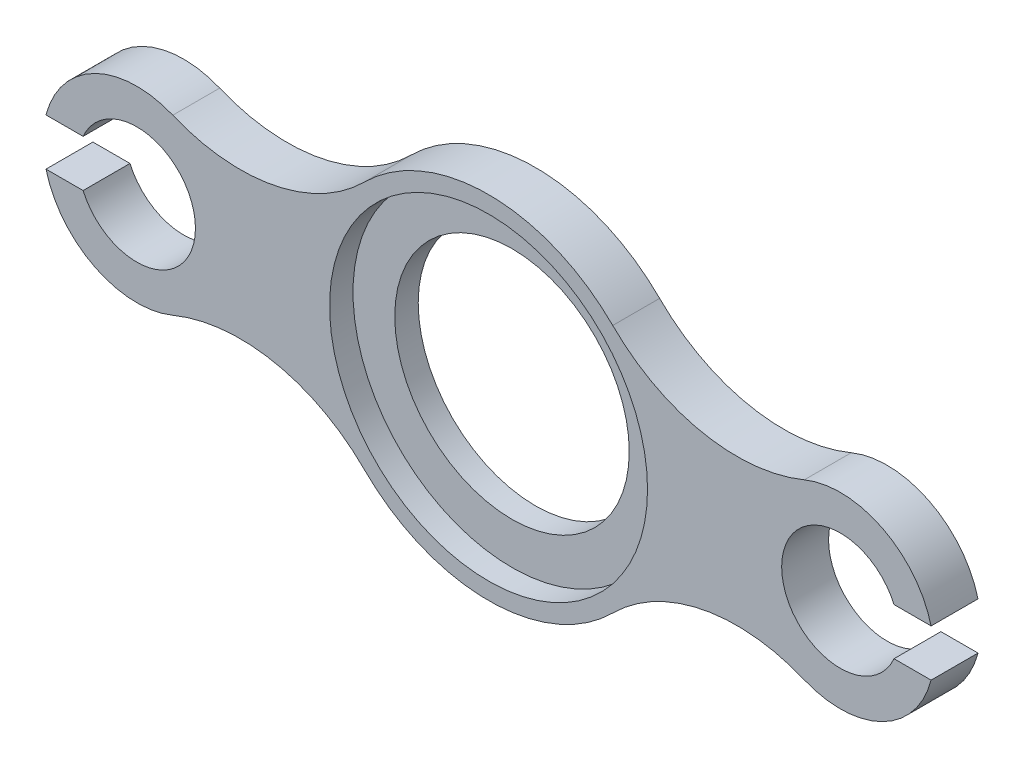
ISO-10303-21;
HEADER;
FILE_DESCRIPTION(('STEP AP214'),'2;1');
FILE_NAME('part.step','',(''),(''),'','','');
FILE_SCHEMA(('AUTOMOTIVE_DESIGN { 1 0 10303 214 1 1 1 1 }'));
ENDSEC;
DATA;
#1=APPLICATION_CONTEXT('core data for automotive mechanical design processes');
#2=APPLICATION_PROTOCOL_DEFINITION('international standard','automotive_design',2000,#1);
#3=PRODUCT_CONTEXT('',#1,'mechanical');
#4=PRODUCT('Part','Part','',(#3));
#5=PRODUCT_RELATED_PRODUCT_CATEGORY('part','',(#4));
#6=PRODUCT_DEFINITION_FORMATION('','',#4);
#7=PRODUCT_DEFINITION_CONTEXT('part definition',#1,'design');
#8=PRODUCT_DEFINITION('design','',#6,#7);
#9=PRODUCT_DEFINITION_SHAPE('','',#8);
#10=(LENGTH_UNIT() NAMED_UNIT(*) SI_UNIT(.MILLI.,.METRE.));
#11=(NAMED_UNIT(*) PLANE_ANGLE_UNIT() SI_UNIT($,.RADIAN.));
#12=(NAMED_UNIT(*) SI_UNIT($,.STERADIAN.) SOLID_ANGLE_UNIT());
#13=UNCERTAINTY_MEASURE_WITH_UNIT(LENGTH_MEASURE(1.E-05),#10,'distance_accuracy_value','');
#14=(GEOMETRIC_REPRESENTATION_CONTEXT(3) GLOBAL_UNCERTAINTY_ASSIGNED_CONTEXT((#13)) GLOBAL_UNIT_ASSIGNED_CONTEXT((#10,
#11,#12)) REPRESENTATION_CONTEXT('',''));
#15=CARTESIAN_POINT('',(0.,0.,0.));
#16=DIRECTION('',(0.,0.,1.));
#17=DIRECTION('',(1.,0.,0.));
#18=AXIS2_PLACEMENT_3D('',#15,#16,#17);
#19=CARTESIAN_POINT('',(0.,-10.,20.));
#20=DIRECTION('',(0.,1.,0.));
#21=DIRECTION('',(0.,0.,1.));
#22=AXIS2_PLACEMENT_3D('',#19,#20,#21);
#23=PLANE('',#22);
#24=DIRECTION('',(1.,0.,0.));
#25=VECTOR('',#24,1.);
#26=CARTESIAN_POINT('',(0.,-10.,0.));
#27=LINE('',#26,#25);
#28=CARTESIAN_POINT('',(-188.729833462074,-10.,0.));
#29=VERTEX_POINT('',#28);
#30=CARTESIAN_POINT('',(-172.912878474779,-10.,0.));
#31=VERTEX_POINT('',#30);
#32=EDGE_CURVE('E195',#29,#31,#27,.T.);
#33=ORIENTED_EDGE('',*,*,#32,.F.);
#34=DIRECTION('',(0.,0.,-1.));
#35=VECTOR('',#34,1.);
#36=CARTESIAN_POINT('',(-188.729833462074,-10.,20.));
#37=LINE('',#36,#35);
#38=CARTESIAN_POINT('',(-188.729833462074,-10.,20.));
#39=VERTEX_POINT('',#38);
#40=EDGE_CURVE('E58',#39,#29,#37,.T.);
#41=ORIENTED_EDGE('',*,*,#40,.F.);
#42=DIRECTION('',(1.,0.,0.));
#43=VECTOR('',#42,1.);
#44=CARTESIAN_POINT('',(0.,-10.,20.));
#45=LINE('',#44,#43);
#46=CARTESIAN_POINT('',(-172.912878474779,-10.,20.));
#47=VERTEX_POINT('',#46);
#48=EDGE_CURVE('E358',#39,#47,#45,.T.);
#49=ORIENTED_EDGE('',*,*,#48,.T.);
#50=DIRECTION('',(0.,0.,-1.));
#51=VECTOR('',#50,1.);
#52=CARTESIAN_POINT('',(-172.912878474779,-10.,20.));
#53=LINE('',#52,#51);
#54=EDGE_CURVE('E66',#47,#31,#53,.T.);
#55=ORIENTED_EDGE('',*,*,#54,.T.);
#56=EDGE_LOOP('',(#33,#41,#49,#55));
#57=FACE_BOUND('',#56,.T.);
#58=ADVANCED_FACE('F49',(#57),#23,.T.);
#59=CARTESIAN_POINT('',(-150.,0.,20.));
#60=DIRECTION('',(0.,0.,-1.));
#61=DIRECTION('',(-1.,0.,0.));
#62=AXIS2_PLACEMENT_3D('',#59,#60,#61);
#63=CYLINDRICAL_SURFACE('',#62,40.);
#64=CARTESIAN_POINT('',(-150.,0.,0.));
#65=DIRECTION('',(0.,0.,1.));
#66=DIRECTION('',(1.,0.,0.));
#67=AXIS2_PLACEMENT_3D('',#64,#65,#66);
#68=CIRCLE('',#67,40.);
#69=CARTESIAN_POINT('',(-134.666666666667,-36.9444026733264,0.));
#70=VERTEX_POINT('',#69);
#71=EDGE_CURVE('E197',#29,#70,#68,.T.);
#72=ORIENTED_EDGE('',*,*,#71,.T.);
#73=DIRECTION('',(0.,0.,-1.));
#74=VECTOR('',#73,1.);
#75=CARTESIAN_POINT('',(-134.666666666667,-36.9444026733264,20.));
#76=LINE('',#75,#74);
#77=CARTESIAN_POINT('',(-134.666666666667,-36.9444026733264,20.));
#78=VERTEX_POINT('',#77);
#79=EDGE_CURVE('E267',#78,#70,#76,.T.);
#80=ORIENTED_EDGE('',*,*,#79,.F.);
#81=CARTESIAN_POINT('',(-150.,0.,20.));
#82=DIRECTION('',(0.,0.,1.));
#83=DIRECTION('',(1.,0.,0.));
#84=AXIS2_PLACEMENT_3D('',#81,#82,#83);
#85=CIRCLE('',#84,40.);
#86=EDGE_CURVE('E274',#39,#78,#85,.T.);
#87=ORIENTED_EDGE('',*,*,#86,.F.);
#88=ORIENTED_EDGE('',*,*,#40,.T.);
#89=EDGE_LOOP('',(#72,#80,#87,#88));
#90=FACE_BOUND('',#89,.T.);
#91=ADVANCED_FACE('F271',(#90),#63,.T.);
#92=CARTESIAN_POINT('',(-105.916666666667,-106.215157685813,20.));
#93=DIRECTION('',(0.,0.,-1.));
#94=DIRECTION('',(-1.,0.,0.));
#95=AXIS2_PLACEMENT_3D('',#92,#93,#94);
#96=CYLINDRICAL_SURFACE('',#95,75.);
#97=CARTESIAN_POINT('',(-105.916666666667,-106.215157685813,0.));
#98=DIRECTION('',(0.,0.,1.));
#99=DIRECTION('',(1.,0.,0.));
#100=AXIS2_PLACEMENT_3D('',#97,#98,#99);
#101=CIRCLE('',#100,75.);
#102=CARTESIAN_POINT('',(-52.9583333333333,-53.1075788429067,0.));
#103=VERTEX_POINT('',#102);
#104=EDGE_CURVE('E201',#70,#103,#101,.F.);
#105=ORIENTED_EDGE('',*,*,#104,.T.);
#106=DIRECTION('',(0.,0.,-1.));
#107=VECTOR('',#106,1.);
#108=CARTESIAN_POINT('',(-52.9583333333333,-53.1075788429067,20.));
#109=LINE('',#108,#107);
#110=CARTESIAN_POINT('',(-52.9583333333333,-53.1075788429067,20.));
#111=VERTEX_POINT('',#110);
#112=EDGE_CURVE('E264',#111,#103,#109,.T.);
#113=ORIENTED_EDGE('',*,*,#112,.F.);
#114=CARTESIAN_POINT('',(-105.916666666667,-106.215157685813,20.));
#115=DIRECTION('',(0.,0.,1.));
#116=DIRECTION('',(1.,0.,0.));
#117=AXIS2_PLACEMENT_3D('',#114,#115,#116);
#118=CIRCLE('',#117,75.);
#119=EDGE_CURVE('E366',#78,#111,#118,.F.);
#120=ORIENTED_EDGE('',*,*,#119,.F.);
#121=ORIENTED_EDGE('',*,*,#79,.T.);
#122=EDGE_LOOP('',(#105,#113,#120,#121));
#123=FACE_BOUND('',#122,.T.);
#124=ADVANCED_FACE('F282',(#123),#96,.F.);
#125=CARTESIAN_POINT('',(0.,0.,20.));
#126=DIRECTION('',(0.,0.,-1.));
#127=DIRECTION('',(-1.,0.,0.));
#128=AXIS2_PLACEMENT_3D('',#125,#126,#127);
#129=CYLINDRICAL_SURFACE('',#128,75.);
#130=CARTESIAN_POINT('',(0.,0.,0.));
#131=DIRECTION('',(0.,0.,1.));
#132=DIRECTION('',(1.,0.,0.));
#133=AXIS2_PLACEMENT_3D('',#130,#131,#132);
#134=CIRCLE('',#133,75.);
#135=CARTESIAN_POINT('',(52.9583333333333,-53.1075788429067,0.));
#136=VERTEX_POINT('',#135);
#137=EDGE_CURVE('E204',#103,#136,#134,.T.);
#138=ORIENTED_EDGE('',*,*,#137,.T.);
#139=DIRECTION('',(0.,0.,-1.));
#140=VECTOR('',#139,1.);
#141=CARTESIAN_POINT('',(52.9583333333333,-53.1075788429067,20.));
#142=LINE('',#141,#140);
#143=CARTESIAN_POINT('',(52.9583333333333,-53.1075788429067,20.));
#144=VERTEX_POINT('',#143);
#145=EDGE_CURVE('E262',#144,#136,#142,.T.);
#146=ORIENTED_EDGE('',*,*,#145,.F.);
#147=CARTESIAN_POINT('',(0.,0.,20.));
#148=DIRECTION('',(0.,0.,1.));
#149=DIRECTION('',(1.,0.,0.));
#150=AXIS2_PLACEMENT_3D('',#147,#148,#149);
#151=CIRCLE('',#150,75.);
#152=EDGE_CURVE('E369',#111,#144,#151,.T.);
#153=ORIENTED_EDGE('',*,*,#152,.F.);
#154=ORIENTED_EDGE('',*,*,#112,.T.);
#155=EDGE_LOOP('',(#138,#146,#153,#154));
#156=FACE_BOUND('',#155,.T.);
#157=ADVANCED_FACE('F287',(#156),#129,.T.);
#158=CARTESIAN_POINT('',(105.916666666667,-106.215157685813,20.));
#159=DIRECTION('',(0.,0.,-1.));
#160=DIRECTION('',(-1.,0.,0.));
#161=AXIS2_PLACEMENT_3D('',#158,#159,#160);
#162=CYLINDRICAL_SURFACE('',#161,75.);
#163=CARTESIAN_POINT('',(105.916666666667,-106.215157685813,0.));
#164=DIRECTION('',(0.,0.,1.));
#165=DIRECTION('',(1.,0.,0.));
#166=AXIS2_PLACEMENT_3D('',#163,#164,#165);
#167=CIRCLE('',#166,75.);
#168=CARTESIAN_POINT('',(134.666666666667,-36.9444026733264,0.));
#169=VERTEX_POINT('',#168);
#170=EDGE_CURVE('E207',#169,#136,#167,.T.);
#171=ORIENTED_EDGE('',*,*,#170,.F.);
#172=DIRECTION('',(0.,0.,-1.));
#173=VECTOR('',#172,1.);
#174=CARTESIAN_POINT('',(134.666666666667,-36.9444026733264,20.));
#175=LINE('',#174,#173);
#176=CARTESIAN_POINT('',(134.666666666667,-36.9444026733264,20.));
#177=VERTEX_POINT('',#176);
#178=EDGE_CURVE('E260',#177,#169,#175,.T.);
#179=ORIENTED_EDGE('',*,*,#178,.F.);
#180=CARTESIAN_POINT('',(105.916666666667,-106.215157685813,20.));
#181=DIRECTION('',(0.,0.,1.));
#182=DIRECTION('',(1.,0.,0.));
#183=AXIS2_PLACEMENT_3D('',#180,#181,#182);
#184=CIRCLE('',#183,75.);
#185=EDGE_CURVE('E371',#177,#144,#184,.T.);
#186=ORIENTED_EDGE('',*,*,#185,.T.);
#187=ORIENTED_EDGE('',*,*,#145,.T.);
#188=EDGE_LOOP('',(#171,#179,#186,#187));
#189=FACE_BOUND('',#188,.T.);
#190=ADVANCED_FACE('F291',(#189),#162,.F.);
#191=CARTESIAN_POINT('',(150.,0.,20.));
#192=DIRECTION('',(0.,0.,-1.));
#193=DIRECTION('',(-1.,0.,0.));
#194=AXIS2_PLACEMENT_3D('',#191,#192,#193);
#195=CYLINDRICAL_SURFACE('',#194,40.);
#196=CARTESIAN_POINT('',(150.,0.,0.));
#197=DIRECTION('',(0.,0.,1.));
#198=DIRECTION('',(1.,0.,0.));
#199=AXIS2_PLACEMENT_3D('',#196,#197,#198);
#200=CIRCLE('',#199,40.);
#201=CARTESIAN_POINT('',(188.729833462074,-10.,0.));
#202=VERTEX_POINT('',#201);
#203=EDGE_CURVE('E210',#202,#169,#200,.F.);
#204=ORIENTED_EDGE('',*,*,#203,.F.);
#205=DIRECTION('',(0.,0.,-1.));
#206=VECTOR('',#205,1.);
#207=CARTESIAN_POINT('',(188.729833462074,-10.,20.));
#208=LINE('',#207,#206);
#209=CARTESIAN_POINT('',(188.729833462074,-10.,20.));
#210=VERTEX_POINT('',#209);
#211=EDGE_CURVE('E258',#210,#202,#208,.T.);
#212=ORIENTED_EDGE('',*,*,#211,.F.);
#213=CARTESIAN_POINT('',(150.,0.,20.));
#214=DIRECTION('',(0.,0.,1.));
#215=DIRECTION('',(1.,0.,0.));
#216=AXIS2_PLACEMENT_3D('',#213,#214,#215);
#217=CIRCLE('',#216,40.);
#218=EDGE_CURVE('E374',#210,#177,#217,.F.);
#219=ORIENTED_EDGE('',*,*,#218,.T.);
#220=ORIENTED_EDGE('',*,*,#178,.T.);
#221=EDGE_LOOP('',(#204,#212,#219,#220));
#222=FACE_BOUND('',#221,.T.);
#223=ADVANCED_FACE('F295',(#222),#195,.T.);
#224=CARTESIAN_POINT('',(0.,-10.,20.));
#225=DIRECTION('',(0.,-1.,0.));
#226=DIRECTION('',(0.,0.,-1.));
#227=AXIS2_PLACEMENT_3D('',#224,#225,#226);
#228=PLANE('',#227);
#229=DIRECTION('',(-1.,0.,0.));
#230=VECTOR('',#229,1.);
#231=CARTESIAN_POINT('',(0.,-10.,0.));
#232=LINE('',#231,#230);
#233=CARTESIAN_POINT('',(172.912878474779,-10.,0.));
#234=VERTEX_POINT('',#233);
#235=EDGE_CURVE('E213',#202,#234,#232,.T.);
#236=ORIENTED_EDGE('',*,*,#235,.T.);
#237=DIRECTION('',(0.,0.,-1.));
#238=VECTOR('',#237,1.);
#239=CARTESIAN_POINT('',(172.912878474779,-10.,20.));
#240=LINE('',#239,#238);
#241=CARTESIAN_POINT('',(172.912878474779,-10.,20.));
#242=VERTEX_POINT('',#241);
#243=EDGE_CURVE('E255',#242,#234,#240,.T.);
#244=ORIENTED_EDGE('',*,*,#243,.F.);
#245=DIRECTION('',(-1.,0.,0.));
#246=VECTOR('',#245,1.);
#247=CARTESIAN_POINT('',(0.,-10.,20.));
#248=LINE('',#247,#246);
#249=EDGE_CURVE('E377',#210,#242,#248,.T.);
#250=ORIENTED_EDGE('',*,*,#249,.F.);
#251=ORIENTED_EDGE('',*,*,#211,.T.);
#252=EDGE_LOOP('',(#236,#244,#250,#251));
#253=FACE_BOUND('',#252,.T.);
#254=ADVANCED_FACE('F299',(#253),#228,.F.);
#255=CARTESIAN_POINT('',(150.,0.,20.));
#256=DIRECTION('',(0.,0.,-1.));
#257=DIRECTION('',(-1.,0.,0.));
#258=AXIS2_PLACEMENT_3D('',#255,#256,#257);
#259=CYLINDRICAL_SURFACE('',#258,25.);
#260=CARTESIAN_POINT('',(150.,0.,0.));
#261=DIRECTION('',(0.,0.,1.));
#262=DIRECTION('',(1.,0.,0.));
#263=AXIS2_PLACEMENT_3D('',#260,#261,#262);
#264=CIRCLE('',#263,25.);
#265=CARTESIAN_POINT('',(172.912878474779,10.,0.));
#266=VERTEX_POINT('',#265);
#267=EDGE_CURVE('E216',#234,#266,#264,.F.);
#268=ORIENTED_EDGE('',*,*,#267,.T.);
#269=DIRECTION('',(0.,0.,-1.));
#270=VECTOR('',#269,1.);
#271=CARTESIAN_POINT('',(172.912878474779,10.,20.));
#272=LINE('',#271,#270);
#273=CARTESIAN_POINT('',(172.912878474779,10.,20.));
#274=VERTEX_POINT('',#273);
#275=EDGE_CURVE('E253',#274,#266,#272,.T.);
#276=ORIENTED_EDGE('',*,*,#275,.F.);
#277=CARTESIAN_POINT('',(150.,0.,20.));
#278=DIRECTION('',(0.,0.,1.));
#279=DIRECTION('',(1.,0.,0.));
#280=AXIS2_PLACEMENT_3D('',#277,#278,#279);
#281=CIRCLE('',#280,25.);
#282=EDGE_CURVE('E380',#242,#274,#281,.F.);
#283=ORIENTED_EDGE('',*,*,#282,.F.);
#284=ORIENTED_EDGE('',*,*,#243,.T.);
#285=EDGE_LOOP('',(#268,#276,#283,#284));
#286=FACE_BOUND('',#285,.T.);
#287=ADVANCED_FACE('F303',(#286),#259,.F.);
#288=CARTESIAN_POINT('',(0.,10.,20.));
#289=DIRECTION('',(0.,-1.,0.));
#290=DIRECTION('',(0.,0.,-1.));
#291=AXIS2_PLACEMENT_3D('',#288,#289,#290);
#292=PLANE('',#291);
#293=DIRECTION('',(-1.,0.,0.));
#294=VECTOR('',#293,1.);
#295=CARTESIAN_POINT('',(0.,10.,0.));
#296=LINE('',#295,#294);
#297=CARTESIAN_POINT('',(188.729833462074,10.,0.));
#298=VERTEX_POINT('',#297);
#299=EDGE_CURVE('E219',#298,#266,#296,.T.);
#300=ORIENTED_EDGE('',*,*,#299,.F.);
#301=DIRECTION('',(0.,0.,-1.));
#302=VECTOR('',#301,1.);
#303=CARTESIAN_POINT('',(188.729833462074,10.,20.));
#304=LINE('',#303,#302);
#305=CARTESIAN_POINT('',(188.729833462074,10.,20.));
#306=VERTEX_POINT('',#305);
#307=EDGE_CURVE('E251',#306,#298,#304,.T.);
#308=ORIENTED_EDGE('',*,*,#307,.F.);
#309=DIRECTION('',(-1.,0.,0.));
#310=VECTOR('',#309,1.);
#311=CARTESIAN_POINT('',(0.,10.,20.));
#312=LINE('',#311,#310);
#313=EDGE_CURVE('E382',#306,#274,#312,.T.);
#314=ORIENTED_EDGE('',*,*,#313,.T.);
#315=ORIENTED_EDGE('',*,*,#275,.T.);
#316=EDGE_LOOP('',(#300,#308,#314,#315));
#317=FACE_BOUND('',#316,.T.);
#318=ADVANCED_FACE('F307',(#317),#292,.T.);
#319=CARTESIAN_POINT('',(150.,0.,20.));
#320=DIRECTION('',(0.,0.,-1.));
#321=DIRECTION('',(-1.,0.,0.));
#322=AXIS2_PLACEMENT_3D('',#319,#320,#321);
#323=CYLINDRICAL_SURFACE('',#322,40.);
#324=CARTESIAN_POINT('',(150.,0.,0.));
#325=DIRECTION('',(0.,0.,1.));
#326=DIRECTION('',(1.,0.,0.));
#327=AXIS2_PLACEMENT_3D('',#324,#325,#326);
#328=CIRCLE('',#327,40.);
#329=CARTESIAN_POINT('',(134.666666666667,36.9444026733264,0.));
#330=VERTEX_POINT('',#329);
#331=EDGE_CURVE('E222',#298,#330,#328,.T.);
#332=ORIENTED_EDGE('',*,*,#331,.T.);
#333=DIRECTION('',(0.,0.,-1.));
#334=VECTOR('',#333,1.);
#335=CARTESIAN_POINT('',(134.666666666667,36.9444026733264,20.));
#336=LINE('',#335,#334);
#337=CARTESIAN_POINT('',(134.666666666667,36.9444026733264,20.));
#338=VERTEX_POINT('',#337);
#339=EDGE_CURVE('E248',#338,#330,#336,.T.);
#340=ORIENTED_EDGE('',*,*,#339,.F.);
#341=CARTESIAN_POINT('',(150.,0.,20.));
#342=DIRECTION('',(0.,0.,1.));
#343=DIRECTION('',(1.,0.,0.));
#344=AXIS2_PLACEMENT_3D('',#341,#342,#343);
#345=CIRCLE('',#344,40.);
#346=EDGE_CURVE('E385',#306,#338,#345,.T.);
#347=ORIENTED_EDGE('',*,*,#346,.F.);
#348=ORIENTED_EDGE('',*,*,#307,.T.);
#349=EDGE_LOOP('',(#332,#340,#347,#348));
#350=FACE_BOUND('',#349,.T.);
#351=ADVANCED_FACE('F311',(#350),#323,.T.);
#352=CARTESIAN_POINT('',(105.916666666667,106.215157685813,20.));
#353=DIRECTION('',(0.,0.,-1.));
#354=DIRECTION('',(-1.,0.,0.));
#355=AXIS2_PLACEMENT_3D('',#352,#353,#354);
#356=CYLINDRICAL_SURFACE('',#355,75.);
#357=CARTESIAN_POINT('',(105.916666666667,106.215157685813,0.));
#358=DIRECTION('',(0.,0.,1.));
#359=DIRECTION('',(1.,0.,0.));
#360=AXIS2_PLACEMENT_3D('',#357,#358,#359);
#361=CIRCLE('',#360,75.);
#362=CARTESIAN_POINT('',(52.9583333333334,53.1075788429067,0.));
#363=VERTEX_POINT('',#362);
#364=EDGE_CURVE('E225',#330,#363,#361,.F.);
#365=ORIENTED_EDGE('',*,*,#364,.T.);
#366=DIRECTION('',(0.,0.,-1.));
#367=VECTOR('',#366,1.);
#368=CARTESIAN_POINT('',(52.9583333333334,53.1075788429067,20.));
#369=LINE('',#368,#367);
#370=CARTESIAN_POINT('',(52.9583333333334,53.1075788429067,20.));
#371=VERTEX_POINT('',#370);
#372=EDGE_CURVE('E246',#371,#363,#369,.T.);
#373=ORIENTED_EDGE('',*,*,#372,.F.);
#374=CARTESIAN_POINT('',(105.916666666667,106.215157685813,20.));
#375=DIRECTION('',(0.,0.,1.));
#376=DIRECTION('',(1.,0.,0.));
#377=AXIS2_PLACEMENT_3D('',#374,#375,#376);
#378=CIRCLE('',#377,75.);
#379=EDGE_CURVE('E388',#338,#371,#378,.F.);
#380=ORIENTED_EDGE('',*,*,#379,.F.);
#381=ORIENTED_EDGE('',*,*,#339,.T.);
#382=EDGE_LOOP('',(#365,#373,#380,#381));
#383=FACE_BOUND('',#382,.T.);
#384=ADVANCED_FACE('F315',(#383),#356,.F.);
#385=CARTESIAN_POINT('',(0.,0.,20.));
#386=DIRECTION('',(0.,0.,-1.));
#387=DIRECTION('',(-1.,0.,0.));
#388=AXIS2_PLACEMENT_3D('',#385,#386,#387);
#389=CYLINDRICAL_SURFACE('',#388,75.);
#390=CARTESIAN_POINT('',(0.,0.,0.));
#391=DIRECTION('',(0.,0.,1.));
#392=DIRECTION('',(1.,0.,0.));
#393=AXIS2_PLACEMENT_3D('',#390,#391,#392);
#394=CIRCLE('',#393,75.);
#395=CARTESIAN_POINT('',(-52.9583333333334,53.1075788429067,0.));
#396=VERTEX_POINT('',#395);
#397=EDGE_CURVE('E228',#396,#363,#394,.F.);
#398=ORIENTED_EDGE('',*,*,#397,.F.);
#399=DIRECTION('',(0.,0.,-1.));
#400=VECTOR('',#399,1.);
#401=CARTESIAN_POINT('',(-52.9583333333334,53.1075788429067,20.));
#402=LINE('',#401,#400);
#403=CARTESIAN_POINT('',(-52.9583333333334,53.1075788429067,20.));
#404=VERTEX_POINT('',#403);
#405=EDGE_CURVE('E244',#404,#396,#402,.T.);
#406=ORIENTED_EDGE('',*,*,#405,.F.);
#407=CARTESIAN_POINT('',(0.,0.,20.));
#408=DIRECTION('',(0.,0.,1.));
#409=DIRECTION('',(1.,0.,0.));
#410=AXIS2_PLACEMENT_3D('',#407,#408,#409);
#411=CIRCLE('',#410,75.);
#412=EDGE_CURVE('E190',#404,#371,#411,.F.);
#413=ORIENTED_EDGE('',*,*,#412,.T.);
#414=ORIENTED_EDGE('',*,*,#372,.T.);
#415=EDGE_LOOP('',(#398,#406,#413,#414));
#416=FACE_BOUND('',#415,.T.);
#417=ADVANCED_FACE('F319',(#416),#389,.T.);
#418=CARTESIAN_POINT('',(-105.916666666667,106.215157685813,20.));
#419=DIRECTION('',(0.,0.,-1.));
#420=DIRECTION('',(-1.,0.,0.));
#421=AXIS2_PLACEMENT_3D('',#418,#419,#420);
#422=CYLINDRICAL_SURFACE('',#421,75.);
#423=CARTESIAN_POINT('',(-105.916666666667,106.215157685813,0.));
#424=DIRECTION('',(0.,0.,1.));
#425=DIRECTION('',(1.,0.,0.));
#426=AXIS2_PLACEMENT_3D('',#423,#424,#425);
#427=CIRCLE('',#426,75.);
#428=CARTESIAN_POINT('',(-134.666666666667,36.9444026733264,0.));
#429=VERTEX_POINT('',#428);
#430=EDGE_CURVE('E231',#429,#396,#427,.T.);
#431=ORIENTED_EDGE('',*,*,#430,.F.);
#432=DIRECTION('',(0.,0.,-1.));
#433=VECTOR('',#432,1.);
#434=CARTESIAN_POINT('',(-134.666666666667,36.9444026733264,20.));
#435=LINE('',#434,#433);
#436=CARTESIAN_POINT('',(-134.666666666667,36.9444026733264,20.));
#437=VERTEX_POINT('',#436);
#438=EDGE_CURVE('E175',#437,#429,#435,.T.);
#439=ORIENTED_EDGE('',*,*,#438,.F.);
#440=CARTESIAN_POINT('',(-105.916666666667,106.215157685813,20.));
#441=DIRECTION('',(0.,0.,1.));
#442=DIRECTION('',(1.,0.,0.));
#443=AXIS2_PLACEMENT_3D('',#440,#441,#442);
#444=CIRCLE('',#443,75.);
#445=EDGE_CURVE('E188',#437,#404,#444,.T.);
#446=ORIENTED_EDGE('',*,*,#445,.T.);
#447=ORIENTED_EDGE('',*,*,#405,.T.);
#448=EDGE_LOOP('',(#431,#439,#446,#447));
#449=FACE_BOUND('',#448,.T.);
#450=ADVANCED_FACE('F323',(#449),#422,.F.);
#451=CARTESIAN_POINT('',(-150.,0.,20.));
#452=DIRECTION('',(0.,0.,-1.));
#453=DIRECTION('',(-1.,0.,0.));
#454=AXIS2_PLACEMENT_3D('',#451,#452,#453);
#455=CYLINDRICAL_SURFACE('',#454,40.);
#456=CARTESIAN_POINT('',(-150.,0.,0.));
#457=DIRECTION('',(0.,0.,1.));
#458=DIRECTION('',(1.,0.,0.));
#459=AXIS2_PLACEMENT_3D('',#456,#457,#458);
#460=CIRCLE('',#459,40.);
#461=CARTESIAN_POINT('',(-188.729833462074,10.,0.));
#462=VERTEX_POINT('',#461);
#463=EDGE_CURVE('E172',#462,#429,#460,.F.);
#464=ORIENTED_EDGE('',*,*,#463,.F.);
#465=DIRECTION('',(0.,0.,-1.));
#466=VECTOR('',#465,1.);
#467=CARTESIAN_POINT('',(-188.729833462074,10.,20.));
#468=LINE('',#467,#466);
#469=CARTESIAN_POINT('',(-188.729833462074,10.,20.));
#470=VERTEX_POINT('',#469);
#471=EDGE_CURVE('E166',#470,#462,#468,.T.);
#472=ORIENTED_EDGE('',*,*,#471,.F.);
#473=CARTESIAN_POINT('',(-150.,0.,20.));
#474=DIRECTION('',(0.,0.,1.));
#475=DIRECTION('',(1.,0.,0.));
#476=AXIS2_PLACEMENT_3D('',#473,#474,#475);
#477=CIRCLE('',#476,40.);
#478=EDGE_CURVE('E170',#470,#437,#477,.F.);
#479=ORIENTED_EDGE('',*,*,#478,.T.);
#480=ORIENTED_EDGE('',*,*,#438,.T.);
#481=EDGE_LOOP('',(#464,#472,#479,#480));
#482=FACE_BOUND('',#481,.T.);
#483=ADVANCED_FACE('F168',(#482),#455,.T.);
#484=CARTESIAN_POINT('',(0.,10.,20.));
#485=DIRECTION('',(0.,1.,0.));
#486=DIRECTION('',(0.,0.,1.));
#487=AXIS2_PLACEMENT_3D('',#484,#485,#486);
#488=PLANE('',#487);
#489=DIRECTION('',(1.,0.,0.));
#490=VECTOR('',#489,1.);
#491=CARTESIAN_POINT('',(0.,10.,0.));
#492=LINE('',#491,#490);
#493=CARTESIAN_POINT('',(-172.912878474779,10.,0.));
#494=VERTEX_POINT('',#493);
#495=EDGE_CURVE('E235',#462,#494,#492,.T.);
#496=ORIENTED_EDGE('',*,*,#495,.T.);
#497=DIRECTION('',(0.,0.,-1.));
#498=VECTOR('',#497,1.);
#499=CARTESIAN_POINT('',(-172.912878474779,10.,20.));
#500=LINE('',#499,#498);
#501=CARTESIAN_POINT('',(-172.912878474779,10.,20.));
#502=VERTEX_POINT('',#501);
#503=EDGE_CURVE('E117',#502,#494,#500,.T.);
#504=ORIENTED_EDGE('',*,*,#503,.F.);
#505=DIRECTION('',(1.,0.,0.));
#506=VECTOR('',#505,1.);
#507=CARTESIAN_POINT('',(0.,10.,20.));
#508=LINE('',#507,#506);
#509=EDGE_CURVE('E177',#470,#502,#508,.T.);
#510=ORIENTED_EDGE('',*,*,#509,.F.);
#511=ORIENTED_EDGE('',*,*,#471,.T.);
#512=EDGE_LOOP('',(#496,#504,#510,#511));
#513=FACE_BOUND('',#512,.T.);
#514=ADVANCED_FACE('F178',(#513),#488,.F.);
#515=CARTESIAN_POINT('',(0.,0.,20.));
#516=DIRECTION('',(0.,0.,-1.));
#517=DIRECTION('',(-1.,0.,0.));
#518=AXIS2_PLACEMENT_3D('',#515,#516,#517);
#519=CYLINDRICAL_SURFACE('',#518,67.8);
#520=CARTESIAN_POINT('',(0.,0.,10.));
#521=DIRECTION('',(0.,0.,1.));
#522=DIRECTION('',(1.,0.,0.));
#523=AXIS2_PLACEMENT_3D('',#520,#521,#522);
#524=CIRCLE('',#523,67.8);
#525=CARTESIAN_POINT('',(67.8,0.,10.));
#526=VERTEX_POINT('',#525);
#527=EDGE_CURVE('E11',#526,#526,#524,.T.);
#528=ORIENTED_EDGE('',*,*,#527,.F.);
#529=EDGE_LOOP('',(#528));
#530=FACE_BOUND('',#529,.T.);
#531=CARTESIAN_POINT('',(0.,0.,20.));
#532=DIRECTION('',(0.,0.,1.));
#533=DIRECTION('',(1.,0.,0.));
#534=AXIS2_PLACEMENT_3D('',#531,#532,#533);
#535=CIRCLE('',#534,67.8);
#536=CARTESIAN_POINT('',(67.8,0.,20.));
#537=VERTEX_POINT('',#536);
#538=EDGE_CURVE('E240',#537,#537,#535,.T.);
#539=ORIENTED_EDGE('',*,*,#538,.T.);
#540=EDGE_LOOP('',(#539));
#541=FACE_BOUND('',#540,.T.);
#542=ADVANCED_FACE('F51',(#530,#541),#519,.F.);
#543=CARTESIAN_POINT('',(-150.,0.,20.));
#544=DIRECTION('',(0.,0.,-1.));
#545=DIRECTION('',(-1.,0.,0.));
#546=AXIS2_PLACEMENT_3D('',#543,#544,#545);
#547=CYLINDRICAL_SURFACE('',#546,25.);
#548=CARTESIAN_POINT('',(-150.,0.,0.));
#549=DIRECTION('',(0.,0.,1.));
#550=DIRECTION('',(1.,0.,0.));
#551=AXIS2_PLACEMENT_3D('',#548,#549,#550);
#552=CIRCLE('',#551,25.);
#553=EDGE_CURVE('E237',#31,#494,#552,.T.);
#554=ORIENTED_EDGE('',*,*,#553,.F.);
#555=ORIENTED_EDGE('',*,*,#54,.F.);
#556=CARTESIAN_POINT('',(-150.,0.,20.));
#557=DIRECTION('',(0.,0.,1.));
#558=DIRECTION('',(1.,0.,0.));
#559=AXIS2_PLACEMENT_3D('',#556,#557,#558);
#560=CIRCLE('',#559,25.);
#561=EDGE_CURVE('E181',#47,#502,#560,.T.);
#562=ORIENTED_EDGE('',*,*,#561,.T.);
#563=ORIENTED_EDGE('',*,*,#503,.T.);
#564=EDGE_LOOP('',(#554,#555,#562,#563));
#565=FACE_BOUND('',#564,.T.);
#566=ADVANCED_FACE('F332',(#565),#547,.F.);
#567=CARTESIAN_POINT('',(0.,0.,20.));
#568=DIRECTION('',(0.,0.,1.));
#569=DIRECTION('',(1.,0.,0.));
#570=AXIS2_PLACEMENT_3D('',#567,#568,#569);
#571=PLANE('',#570);
#572=ORIENTED_EDGE('',*,*,#538,.F.);
#573=EDGE_LOOP('',(#572));
#574=FACE_BOUND('',#573,.T.);
#575=ORIENTED_EDGE('',*,*,#48,.F.);
#576=ORIENTED_EDGE('',*,*,#86,.T.);
#577=ORIENTED_EDGE('',*,*,#119,.T.);
#578=ORIENTED_EDGE('',*,*,#152,.T.);
#579=ORIENTED_EDGE('',*,*,#185,.F.);
#580=ORIENTED_EDGE('',*,*,#218,.F.);
#581=ORIENTED_EDGE('',*,*,#249,.T.);
#582=ORIENTED_EDGE('',*,*,#282,.T.);
#583=ORIENTED_EDGE('',*,*,#313,.F.);
#584=ORIENTED_EDGE('',*,*,#346,.T.);
#585=ORIENTED_EDGE('',*,*,#379,.T.);
#586=ORIENTED_EDGE('',*,*,#412,.F.);
#587=ORIENTED_EDGE('',*,*,#445,.F.);
#588=ORIENTED_EDGE('',*,*,#478,.F.);
#589=ORIENTED_EDGE('',*,*,#509,.T.);
#590=ORIENTED_EDGE('',*,*,#561,.F.);
#591=EDGE_LOOP('',(#575,#576,#577,#578,#579,#580,#581,#582,#583,#584,#585,#586,#587,#588,#589,#590));
#592=FACE_BOUND('',#591,.T.);
#593=ADVANCED_FACE('F185',(#574,#592),#571,.T.);
#594=CARTESIAN_POINT('',(0.,0.,0.));
#595=DIRECTION('',(0.,0.,1.));
#596=DIRECTION('',(1.,0.,0.));
#597=AXIS2_PLACEMENT_3D('',#594,#595,#596);
#598=PLANE('',#597);
#599=ORIENTED_EDGE('',*,*,#32,.T.);
#600=ORIENTED_EDGE('',*,*,#553,.T.);
#601=ORIENTED_EDGE('',*,*,#495,.F.);
#602=ORIENTED_EDGE('',*,*,#463,.T.);
#603=ORIENTED_EDGE('',*,*,#430,.T.);
#604=ORIENTED_EDGE('',*,*,#397,.T.);
#605=ORIENTED_EDGE('',*,*,#364,.F.);
#606=ORIENTED_EDGE('',*,*,#331,.F.);
#607=ORIENTED_EDGE('',*,*,#299,.T.);
#608=ORIENTED_EDGE('',*,*,#267,.F.);
#609=ORIENTED_EDGE('',*,*,#235,.F.);
#610=ORIENTED_EDGE('',*,*,#203,.T.);
#611=ORIENTED_EDGE('',*,*,#170,.T.);
#612=ORIENTED_EDGE('',*,*,#137,.F.);
#613=ORIENTED_EDGE('',*,*,#104,.F.);
#614=ORIENTED_EDGE('',*,*,#71,.F.);
#615=EDGE_LOOP('',(#599,#600,#601,#602,#603,#604,#605,#606,#607,#608,#609,#610,#611,#612,#613,#614));
#616=FACE_BOUND('',#615,.T.);
#617=CARTESIAN_POINT('',(0.,0.,0.));
#618=DIRECTION('',(0.,0.,1.));
#619=DIRECTION('',(1.,0.,0.));
#620=AXIS2_PLACEMENT_3D('',#617,#618,#619);
#621=CIRCLE('',#620,50.);
#622=CARTESIAN_POINT('',(50.,0.,0.));
#623=VERTEX_POINT('',#622);
#624=EDGE_CURVE('E362',#623,#623,#621,.T.);
#625=ORIENTED_EDGE('',*,*,#624,.T.);
#626=EDGE_LOOP('',(#625));
#627=FACE_BOUND('',#626,.T.);
#628=ADVANCED_FACE('F276',(#616,#627),#598,.F.);
#629=CARTESIAN_POINT('',(0.,0.,10.));
#630=DIRECTION('',(0.,0.,-1.));
#631=DIRECTION('',(-1.,0.,0.));
#632=AXIS2_PLACEMENT_3D('',#629,#630,#631);
#633=CYLINDRICAL_SURFACE('',#632,50.);
#634=CARTESIAN_POINT('',(0.,0.,10.));
#635=DIRECTION('',(0.,0.,1.));
#636=DIRECTION('',(1.,0.,0.));
#637=AXIS2_PLACEMENT_3D('',#634,#635,#636);
#638=CIRCLE('',#637,50.);
#639=CARTESIAN_POINT('',(50.,0.,10.));
#640=VERTEX_POINT('',#639);
#641=EDGE_CURVE('E198',#640,#640,#638,.T.);
#642=ORIENTED_EDGE('',*,*,#641,.T.);
#643=EDGE_LOOP('',(#642));
#644=FACE_BOUND('',#643,.T.);
#645=ORIENTED_EDGE('',*,*,#624,.F.);
#646=EDGE_LOOP('',(#645));
#647=FACE_BOUND('',#646,.T.);
#648=ADVANCED_FACE('F337',(#644,#647),#633,.F.);
#649=CARTESIAN_POINT('',(0.,0.,10.));
#650=DIRECTION('',(0.,0.,1.));
#651=DIRECTION('',(1.,0.,0.));
#652=AXIS2_PLACEMENT_3D('',#649,#650,#651);
#653=PLANE('',#652);
#654=ORIENTED_EDGE('',*,*,#641,.F.);
#655=EDGE_LOOP('',(#654));
#656=FACE_BOUND('',#655,.T.);
#657=ORIENTED_EDGE('',*,*,#527,.T.);
#658=EDGE_LOOP('',(#657));
#659=FACE_BOUND('',#658,.T.);
#660=ADVANCED_FACE('F343',(#656,#659),#653,.T.);
#661=CLOSED_SHELL('',(#58,#91,#124,#157,#190,#223,#254,#287,#318,#351,#384,#417,#450,#483,#514,
#542,#566,#593,#628,#648,#660));
#662=MANIFOLD_SOLID_BREP('B2',#661);
#663=ADVANCED_BREP_SHAPE_REPRESENTATION('',(#18,#662),#14);
#664=SHAPE_DEFINITION_REPRESENTATION(#9,#663);
ENDSEC;
END-ISO-10303-21;
